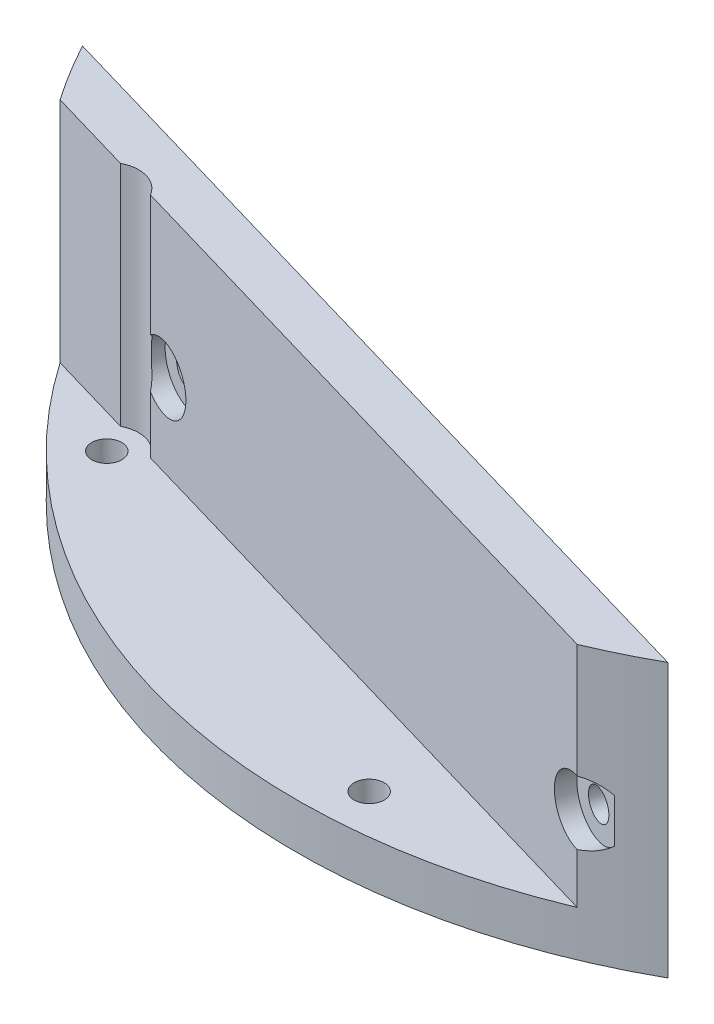
ISO-10303-21;
HEADER;
FILE_DESCRIPTION(('STEP AP214'),'2;1');
FILE_NAME('part.step','',(''),(''),'','','');
FILE_SCHEMA(('AUTOMOTIVE_DESIGN { 1 0 10303 214 1 1 1 1 }'));
ENDSEC;
DATA;
#1=APPLICATION_CONTEXT('core data for automotive mechanical design processes');
#2=APPLICATION_PROTOCOL_DEFINITION('international standard','automotive_design',2000,#1);
#3=PRODUCT_CONTEXT('',#1,'mechanical');
#4=PRODUCT('Part','Part','',(#3));
#5=PRODUCT_RELATED_PRODUCT_CATEGORY('part','',(#4));
#6=PRODUCT_DEFINITION_FORMATION('','',#4);
#7=PRODUCT_DEFINITION_CONTEXT('part definition',#1,'design');
#8=PRODUCT_DEFINITION('design','',#6,#7);
#9=PRODUCT_DEFINITION_SHAPE('','',#8);
#10=(LENGTH_UNIT() NAMED_UNIT(*) SI_UNIT(.MILLI.,.METRE.));
#11=(NAMED_UNIT(*) PLANE_ANGLE_UNIT() SI_UNIT($,.RADIAN.));
#12=(NAMED_UNIT(*) SI_UNIT($,.STERADIAN.) SOLID_ANGLE_UNIT());
#13=UNCERTAINTY_MEASURE_WITH_UNIT(LENGTH_MEASURE(1.E-05),#10,'distance_accuracy_value','');
#14=(GEOMETRIC_REPRESENTATION_CONTEXT(3) GLOBAL_UNCERTAINTY_ASSIGNED_CONTEXT((#13)) GLOBAL_UNIT_ASSIGNED_CONTEXT((#10,
#11,#12)) REPRESENTATION_CONTEXT('',''));
#15=CARTESIAN_POINT('',(0.,0.,0.));
#16=DIRECTION('',(0.,0.,1.));
#17=DIRECTION('',(1.,0.,0.));
#18=AXIS2_PLACEMENT_3D('',#15,#16,#17);
#19=CARTESIAN_POINT('',(-13.0108216211059,5.,44.5801763202411));
#20=DIRECTION('',(-0.280164117594872,0.,0.959952117145583));
#21=DIRECTION('',(0.959952117145583,0.,0.280164117594872));
#22=AXIS2_PLACEMENT_3D('',#19,#20,#21);
#23=PLANE('',#22);
#24=CARTESIAN_POINT('',(26.888204443433,14.,56.2247940367006));
#25=DIRECTION('',(-0.280164117594872,0.,0.959952117145583));
#26=DIRECTION('',(0.959952117145583,0.,0.280164117594872));
#27=AXIS2_PLACEMENT_3D('',#24,#25,#26);
#28=CIRCLE('',#27,1.64999999999999);
#29=CARTESIAN_POINT('',(28.4721254367232,14.,56.6870648307322));
#30=VERTEX_POINT('',#29);
#31=EDGE_CURVE('E145',#30,#30,#28,.T.);
#32=ORIENTED_EDGE('',*,*,#31,.T.);
#33=EDGE_LOOP('',(#32));
#34=FACE_BOUND('',#33,.T.);
#35=CARTESIAN_POINT('',(-36.9486113467483,14.,37.5938802166416));
#36=DIRECTION('',(-0.280164117594872,0.,0.959952117145583));
#37=DIRECTION('',(0.959952117145583,0.,0.280164117594872));
#38=AXIS2_PLACEMENT_3D('',#35,#36,#37);
#39=CIRCLE('',#38,1.65);
#40=CARTESIAN_POINT('',(-35.3646903534581,14.,38.0561510106732));
#41=VERTEX_POINT('',#40);
#42=EDGE_CURVE('E176',#41,#41,#39,.T.);
#43=ORIENTED_EDGE('',*,*,#42,.T.);
#44=EDGE_LOOP('',(#43));
#45=FACE_BOUND('',#44,.T.);
#46=DIRECTION('',(0.,-1.,0.));
#47=VECTOR('',#46,1.);
#48=CARTESIAN_POINT('',(-58.3667956543592,30.,31.3429364457493));
#49=LINE('',#48,#47);
#50=CARTESIAN_POINT('',(-58.3667956543592,30.,31.3429364457492));
#51=VERTEX_POINT('',#50);
#52=CARTESIAN_POINT('',(-58.3667956543592,0.,31.3429364457493));
#53=VERTEX_POINT('',#52);
#54=EDGE_CURVE('E120',#51,#53,#49,.T.);
#55=ORIENTED_EDGE('',*,*,#54,.F.);
#56=DIRECTION('',(-0.959952117145583,0.,-0.280164117594872));
#57=VECTOR('',#56,1.);
#58=CARTESIAN_POINT('',(-58.7697252563864,30.,31.2253405632166));
#59=LINE('',#58,#57);
#60=CARTESIAN_POINT('',(32.3451524121474,30.,57.8174161947328));
#61=VERTEX_POINT('',#60);
#62=EDGE_CURVE('E128',#61,#51,#59,.T.);
#63=ORIENTED_EDGE('',*,*,#62,.F.);
#64=DIRECTION('',(0.,-1.,0.));
#65=VECTOR('',#64,1.);
#66=CARTESIAN_POINT('',(32.3451524121474,30.,57.8174161947329));
#67=LINE('',#66,#65);
#68=CARTESIAN_POINT('',(32.3451524121474,0.,57.8174161947329));
#69=VERTEX_POINT('',#68);
#70=EDGE_CURVE('E109',#69,#61,#67,.F.);
#71=ORIENTED_EDGE('',*,*,#70,.F.);
#72=DIRECTION('',(-0.959952117145583,0.,-0.280164117594872));
#73=VECTOR('',#72,1.);
#74=CARTESIAN_POINT('',(-13.0108216211059,0.,44.5801763202411));
#75=LINE('',#74,#73);
#76=EDGE_CURVE('E160',#69,#53,#75,.T.);
#77=ORIENTED_EDGE('',*,*,#76,.T.);
#78=EDGE_LOOP('',(#55,#63,#71,#77));
#79=FACE_BOUND('',#78,.T.);
#80=ADVANCED_FACE('F41',(#34,#45,#79),#23,.F.);
#81=CARTESIAN_POINT('',(0.,5.,0.));
#82=DIRECTION('',(0.,1.,0.));
#83=DIRECTION('',(0.,0.,1.));
#84=AXIS2_PLACEMENT_3D('',#81,#82,#83);
#85=PLANE('',#84);
#86=CARTESIAN_POINT('',(-43.522422382032,5.,43.522422382032));
#87=DIRECTION('',(0.,1.,0.));
#88=DIRECTION('',(0.,0.,1.));
#89=AXIS2_PLACEMENT_3D('',#86,#87,#88);
#90=CIRCLE('',#89,1.65);
#91=CARTESIAN_POINT('',(-43.522422382032,5.,45.172422382032));
#92=VERTEX_POINT('',#91);
#93=EDGE_CURVE('E157',#92,#92,#90,.T.);
#94=ORIENTED_EDGE('',*,*,#93,.F.);
#95=EDGE_LOOP('',(#94));
#96=FACE_BOUND('',#95,.T.);
#97=CARTESIAN_POINT('',(3.22127810675323,5.,61.465647864144));
#98=DIRECTION('',(0.,1.,0.));
#99=DIRECTION('',(0.,0.,1.));
#100=AXIS2_PLACEMENT_3D('',#97,#98,#99);
#101=CIRCLE('',#100,1.65);
#102=CARTESIAN_POINT('',(3.22127810675323,5.,63.115647864144));
#103=VERTEX_POINT('',#102);
#104=EDGE_CURVE('E49',#103,#103,#101,.T.);
#105=ORIENTED_EDGE('',*,*,#104,.F.);
#106=EDGE_LOOP('',(#105));
#107=FACE_BOUND('',#106,.T.);
#108=DIRECTION('',(0.959952117145583,0.,0.280164117594872));
#109=VECTOR('',#108,1.);
#110=CARTESIAN_POINT('',(-54.9442366709352,5.,37.5504108718968));
#111=LINE('',#110,#109);
#112=CARTESIAN_POINT('',(-54.488796953541,5.,37.6833319460445));
#113=VERTEX_POINT('',#112);
#114=CARTESIAN_POINT('',(-45.1315629455846,5.,40.4142610852635));
#115=VERTEX_POINT('',#114);
#116=EDGE_CURVE('E142',#113,#115,#111,.T.);
#117=ORIENTED_EDGE('',*,*,#116,.F.);
#118=CARTESIAN_POINT('',(0.,5.,0.));
#119=DIRECTION('',(0.,1.,0.));
#120=DIRECTION('',(0.,0.,1.));
#121=AXIS2_PLACEMENT_3D('',#118,#119,#120);
#122=CIRCLE('',#121,66.25);
#123=CARTESIAN_POINT('',(25.6655125353805,5.,61.0765418658934));
#124=VERTEX_POINT('',#123);
#125=EDGE_CURVE('E303',#113,#124,#122,.T.);
#126=ORIENTED_EDGE('',*,*,#125,.T.);
#127=DIRECTION('',(0.959952117145583,0.,0.280164117594872));
#128=VECTOR('',#127,1.);
#129=CARTESIAN_POINT('',(-40.4940474039868,5.,41.7677301034971));
#130=LINE('',#129,#128);
#131=CARTESIAN_POINT('',(-40.4940474039868,5.,41.7677301034971));
#132=VERTEX_POINT('',#131);
#133=EDGE_CURVE('E148',#132,#124,#130,.T.);
#134=ORIENTED_EDGE('',*,*,#133,.F.);
#135=CARTESIAN_POINT('',(-43.522422382032,5.,43.522422382032));
#136=DIRECTION('',(0.,-1.,0.));
#137=DIRECTION('',(0.,0.,1.));
#138=AXIS2_PLACEMENT_3D('',#135,#136,#137);
#139=CIRCLE('',#138,3.5);
#140=EDGE_CURVE('E144',#115,#132,#139,.T.);
#141=ORIENTED_EDGE('',*,*,#140,.F.);
#142=EDGE_LOOP('',(#117,#126,#134,#141));
#143=FACE_BOUND('',#142,.T.);
#144=ADVANCED_FACE('F231',(#96,#107,#143),#85,.T.);
#145=CARTESIAN_POINT('',(0.,0.,0.));
#146=DIRECTION('',(0.,1.,0.));
#147=DIRECTION('',(0.,0.,1.));
#148=AXIS2_PLACEMENT_3D('',#145,#146,#147);
#149=PLANE('',#148);
#150=CARTESIAN_POINT('',(3.22127810675323,0.,61.465647864144));
#151=DIRECTION('',(0.,1.,0.));
#152=DIRECTION('',(0.,0.,1.));
#153=AXIS2_PLACEMENT_3D('',#150,#151,#152);
#154=CIRCLE('',#153,1.65);
#155=CARTESIAN_POINT('',(3.22127810675323,0.,63.115647864144));
#156=VERTEX_POINT('',#155);
#157=EDGE_CURVE('E165',#156,#156,#154,.T.);
#158=ORIENTED_EDGE('',*,*,#157,.T.);
#159=EDGE_LOOP('',(#158));
#160=FACE_BOUND('',#159,.T.);
#161=CARTESIAN_POINT('',(-43.522422382032,0.,43.522422382032));
#162=DIRECTION('',(0.,1.,0.));
#163=DIRECTION('',(0.,0.,1.));
#164=AXIS2_PLACEMENT_3D('',#161,#162,#163);
#165=CIRCLE('',#164,1.65);
#166=CARTESIAN_POINT('',(-43.522422382032,0.,45.172422382032));
#167=VERTEX_POINT('',#166);
#168=EDGE_CURVE('E156',#167,#167,#165,.T.);
#169=ORIENTED_EDGE('',*,*,#168,.T.);
#170=EDGE_LOOP('',(#169));
#171=FACE_BOUND('',#170,.T.);
#172=CARTESIAN_POINT('',(0.,0.,0.));
#173=DIRECTION('',(0.,-1.,0.));
#174=DIRECTION('',(0.,0.,-1.));
#175=AXIS2_PLACEMENT_3D('',#172,#173,#174);
#176=CIRCLE('',#175,66.25);
#177=EDGE_CURVE('E115',#69,#53,#176,.T.);
#178=ORIENTED_EDGE('',*,*,#177,.T.);
#179=ORIENTED_EDGE('',*,*,#76,.F.);
#180=EDGE_LOOP('',(#178,#179));
#181=FACE_BOUND('',#180,.T.);
#182=ADVANCED_FACE('F228',(#160,#171,#181),#149,.F.);
#183=CARTESIAN_POINT('',(-54.9442366709352,30.,37.5504108718968));
#184=DIRECTION('',(0.280164117594872,0.,-0.959952117145583));
#185=DIRECTION('',(-0.959952117145583,0.,-0.280164117594872));
#186=AXIS2_PLACEMENT_3D('',#183,#184,#185);
#187=PLANE('',#186);
#188=DIRECTION('',(0.,-1.,0.));
#189=VECTOR('',#188,1.);
#190=CARTESIAN_POINT('',(-54.488796953541,30.,37.6833319460445));
#191=LINE('',#190,#189);
#192=CARTESIAN_POINT('',(-54.488796953541,30.,37.6833319460445));
#193=VERTEX_POINT('',#192);
#194=EDGE_CURVE('E121',#113,#193,#191,.F.);
#195=ORIENTED_EDGE('',*,*,#194,.F.);
#196=ORIENTED_EDGE('',*,*,#116,.T.);
#197=DIRECTION('',(0.,-1.,0.));
#198=VECTOR('',#197,1.);
#199=CARTESIAN_POINT('',(-45.1315629455846,30.,40.4142610852635));
#200=LINE('',#199,#198);
#201=CARTESIAN_POINT('',(-45.1315629455846,30.,40.4142610852635));
#202=VERTEX_POINT('',#201);
#203=EDGE_CURVE('E153',#202,#115,#200,.T.);
#204=ORIENTED_EDGE('',*,*,#203,.F.);
#205=DIRECTION('',(0.959952117145583,0.,0.280164117594872));
#206=VECTOR('',#205,1.);
#207=CARTESIAN_POINT('',(-54.9442366709352,30.,37.5504108718968));
#208=LINE('',#207,#206);
#209=EDGE_CURVE('E150',#193,#202,#208,.T.);
#210=ORIENTED_EDGE('',*,*,#209,.F.);
#211=EDGE_LOOP('',(#195,#196,#204,#210));
#212=FACE_BOUND('',#211,.T.);
#213=ADVANCED_FACE('F223',(#212),#187,.F.);
#214=CARTESIAN_POINT('',(-40.4940474039868,30.,41.7677301034971));
#215=DIRECTION('',(0.280164117594872,0.,-0.959952117145583));
#216=DIRECTION('',(-0.959952117145583,0.,-0.280164117594872));
#217=AXIS2_PLACEMENT_3D('',#214,#215,#216);
#218=PLANE('',#217);
#219=DIRECTION('',(0.,-1.,0.));
#220=VECTOR('',#219,1.);
#221=CARTESIAN_POINT('',(25.6655125353805,30.,61.0765418658934));
#222=LINE('',#221,#220);
#223=CARTESIAN_POINT('',(25.6655125353805,30.,61.0765418658934));
#224=VERTEX_POINT('',#223);
#225=CARTESIAN_POINT('',(25.6655125353805,17.4950776099976,61.0765418658934));
#226=VERTEX_POINT('',#225);
#227=EDGE_CURVE('E301',#224,#226,#222,.T.);
#228=ORIENTED_EDGE('',*,*,#227,.F.);
#229=DIRECTION('',(0.959952117145583,0.,0.280164117594872));
#230=VECTOR('',#229,1.);
#231=CARTESIAN_POINT('',(-40.4940474039868,30.,41.7677301034971));
#232=LINE('',#231,#230);
#233=CARTESIAN_POINT('',(-40.4940474039868,30.,41.7677301034971));
#234=VERTEX_POINT('',#233);
#235=EDGE_CURVE('E130',#234,#224,#232,.T.);
#236=ORIENTED_EDGE('',*,*,#235,.F.);
#237=DIRECTION('',(0.,-1.,0.));
#238=VECTOR('',#237,1.);
#239=CARTESIAN_POINT('',(-40.4940474039868,30.,41.7677301034971));
#240=LINE('',#239,#238);
#241=CARTESIAN_POINT('',(-40.4940474039868,16.6942272149969,41.7677301034971));
#242=VERTEX_POINT('',#241);
#243=EDGE_CURVE('E136',#234,#242,#240,.T.);
#244=ORIENTED_EDGE('',*,*,#243,.T.);
#245=CARTESIAN_POINT('',(-38.3494319347227,14.,42.3936408023695));
#246=DIRECTION('',(-0.280164117594872,0.,0.959952117145583));
#247=DIRECTION('',(0.959952117145583,0.,0.280164117594872));
#248=AXIS2_PLACEMENT_3D('',#245,#246,#247);
#249=CIRCLE('',#248,3.5);
#250=CARTESIAN_POINT('',(-40.4940474039868,11.3057727850031,41.7677301034971));
#251=VERTEX_POINT('',#250);
#252=EDGE_CURVE('E287',#251,#242,#249,.T.);
#253=ORIENTED_EDGE('',*,*,#252,.F.);
#254=EDGE_CURVE('E134',#251,#132,#240,.T.);
#255=ORIENTED_EDGE('',*,*,#254,.T.);
#256=ORIENTED_EDGE('',*,*,#133,.T.);
#257=CARTESIAN_POINT('',(25.6655125353805,10.5049223900024,61.0765418658934));
#258=VERTEX_POINT('',#257);
#259=EDGE_CURVE('E304',#258,#124,#222,.T.);
#260=ORIENTED_EDGE('',*,*,#259,.F.);
#261=CARTESIAN_POINT('',(25.4873838554586,14.,61.0245546224285));
#262=DIRECTION('',(-0.280164117594872,0.,0.959952117145583));
#263=DIRECTION('',(0.959952117145583,0.,0.280164117594872));
#264=AXIS2_PLACEMENT_3D('',#261,#262,#263);
#265=CIRCLE('',#264,3.5);
#266=EDGE_CURVE('E284',#226,#258,#265,.T.);
#267=ORIENTED_EDGE('',*,*,#266,.F.);
#268=EDGE_LOOP('',(#228,#236,#244,#253,#255,#256,#260,#267));
#269=FACE_BOUND('',#268,.T.);
#270=ADVANCED_FACE('F221',(#269),#218,.F.);
#271=CARTESIAN_POINT('',(0.,30.,0.));
#272=DIRECTION('',(0.,1.,0.));
#273=DIRECTION('',(0.,0.,1.));
#274=AXIS2_PLACEMENT_3D('',#271,#272,#273);
#275=PLANE('',#274);
#276=ORIENTED_EDGE('',*,*,#235,.T.);
#277=CARTESIAN_POINT('',(0.,30.,0.));
#278=DIRECTION('',(0.,-1.,0.));
#279=DIRECTION('',(0.,0.,-1.));
#280=AXIS2_PLACEMENT_3D('',#277,#278,#279);
#281=CIRCLE('',#280,66.25);
#282=EDGE_CURVE('E112',#61,#224,#281,.T.);
#283=ORIENTED_EDGE('',*,*,#282,.F.);
#284=ORIENTED_EDGE('',*,*,#62,.T.);
#285=EDGE_CURVE('E131',#193,#51,#281,.T.);
#286=ORIENTED_EDGE('',*,*,#285,.F.);
#287=ORIENTED_EDGE('',*,*,#209,.T.);
#288=CARTESIAN_POINT('',(-43.522422382032,30.,43.522422382032));
#289=DIRECTION('',(0.,-1.,0.));
#290=DIRECTION('',(0.,0.,1.));
#291=AXIS2_PLACEMENT_3D('',#288,#289,#290);
#292=CIRCLE('',#291,3.5);
#293=EDGE_CURVE('E138',#202,#234,#292,.T.);
#294=ORIENTED_EDGE('',*,*,#293,.T.);
#295=EDGE_LOOP('',(#276,#283,#284,#286,#287,#294));
#296=FACE_BOUND('',#295,.T.);
#297=ADVANCED_FACE('F126',(#296),#275,.T.);
#298=CARTESIAN_POINT('',(26.0477120906484,14.,59.1046503881374));
#299=DIRECTION('',(-0.280164117594872,0.,0.959952117145583));
#300=DIRECTION('',(0.959952117145583,0.,0.280164117594872));
#301=AXIS2_PLACEMENT_3D('',#298,#299,#300);
#302=CYLINDRICAL_SURFACE('',#301,3.5);
#303=CARTESIAN_POINT('',(28.4819093861633,11.5875367921795,59.8150761741418));
#304=CARTESIAN_POINT('',(28.3744268892253,11.4942026766855,59.8662618349527));
#305=CARTESIAN_POINT('',(28.262506606396,11.4071384533856,59.9191933645326));
#306=CARTESIAN_POINT('',(28.0314257366292,11.2454086954693,60.0276414496423));
#307=CARTESIAN_POINT('',(27.9122743839164,11.1707277840021,60.0831546879432));
#308=CARTESIAN_POINT('',(27.6710674427194,11.0350657101046,60.1946159916516));
#309=CARTESIAN_POINT('',(27.5491535256775,10.9737948856385,60.2505204437388));
#310=CARTESIAN_POINT('',(27.3008091038937,10.8624930885034,60.3634571855226));
#311=CARTESIAN_POINT('',(27.1743774901579,10.8124648979266,60.4204897505904));
#312=CARTESIAN_POINT('',(26.8262957689971,10.6917314686765,60.5761513500884));
#313=CARTESIAN_POINT('',(26.6010881612879,10.6317516215983,60.6754173510321));
#314=CARTESIAN_POINT('',(26.2562865248015,10.5656661658201,60.8250457175174));
#315=CARTESIAN_POINT('',(26.1388960893278,10.547558360551,60.8755867348842));
#316=CARTESIAN_POINT('',(25.902961028312,10.519850744111,60.9763525510729));
#317=CARTESIAN_POINT('',(25.7844162439336,10.5102521210011,61.0265773047661));
#318=CARTESIAN_POINT('',(25.6655125353805,10.5049223900024,61.0765418658934));
#319=B_SPLINE_CURVE_WITH_KNOTS('',3,(#303,#304,#305,#306,#307,#308,#309,#310,#311,#312,#313,
#314,#315,#316,#317,#318),.UNSPECIFIED.,.F.,.F.,(4,2,2,2,2,2,2,4),(0.,0.453434704967621,
0.906302075759054,1.34812622917768,1.79005959590942,2.54739956040174,2.93442165449378,
3.32149777651905),.UNSPECIFIED.);
#320=CARTESIAN_POINT('',(28.4819093861633,11.5875367921794,59.8150761741418));
#321=VERTEX_POINT('',#320);
#322=EDGE_CURVE('E264',#321,#258,#319,.T.);
#323=ORIENTED_EDGE('',*,*,#322,.F.);
#324=CARTESIAN_POINT('',(26.0477120906484,14.,59.1046503881374));
#325=DIRECTION('',(-0.280164117594872,0.,0.959952117145583));
#326=DIRECTION('',(0.959952117145583,0.,0.280164117594872));
#327=AXIS2_PLACEMENT_3D('',#324,#325,#326);
#328=CIRCLE('',#327,3.5);
#329=CARTESIAN_POINT('',(28.4819093861633,16.4124632078206,59.8150761741418));
#330=VERTEX_POINT('',#329);
#331=EDGE_CURVE('E172',#330,#321,#328,.T.);
#332=ORIENTED_EDGE('',*,*,#331,.F.);
#333=CARTESIAN_POINT('',(25.6655125353805,17.4950776099976,61.0765418658934));
#334=CARTESIAN_POINT('',(25.8036854333837,17.488885542517,61.0184837103049));
#335=CARTESIAN_POINT('',(25.9414423221483,17.4769183692864,60.9600394700664));
#336=CARTESIAN_POINT('',(26.2153402442106,17.4414883200504,60.8427520917362));
#337=CARTESIAN_POINT('',(26.3514808493499,17.4180224646618,60.7839088541607));
#338=CARTESIAN_POINT('',(26.6179429665665,17.3603768907799,60.6676870670659));
#339=CARTESIAN_POINT('',(26.7483250513793,17.3264774210455,60.6103083980054));
#340=CARTESIAN_POINT('',(27.0059385129889,17.2477618116034,60.4959637296411));
#341=CARTESIAN_POINT('',(27.1331701526938,17.2029465862326,60.4389976961848));
#342=CARTESIAN_POINT('',(27.3673549076727,17.1088273772459,60.3332800977232));
#343=CARTESIAN_POINT('',(27.4747976053172,17.0608597753892,60.284421527747));
#344=CARTESIAN_POINT('',(27.6859472940192,16.9564821476321,60.1877421539485));
#345=CARTESIAN_POINT('',(27.7896555050708,16.900074910438,60.1399210132828));
#346=CARTESIAN_POINT('',(27.9948532019882,16.7773367151002,60.0446811320152));
#347=CARTESIAN_POINT('',(28.0962442428033,16.7108153537007,59.9972941821206));
#348=CARTESIAN_POINT('',(28.2935022933062,16.5685727816028,59.9045260120214));
#349=CARTESIAN_POINT('',(28.3893633885576,16.4928419805805,59.8591469509652));
#350=CARTESIAN_POINT('',(28.4819093861633,16.4124632078206,59.8150761741418));
#351=B_SPLINE_CURVE_WITH_KNOTS('',3,(#333,#334,#335,#336,#337,#338,#339,#340,#341,#342,#343,
#344,#345,#346,#347,#348,#349,#350),.UNSPECIFIED.,.F.,.F.,(4,2,2,2,2,2,2,2,4),(0.,
0.449904980009137,0.899926595009775,1.33878341113055,1.77760347989564,2.15950030584928,
2.54127121928639,2.93140943431199,3.32195745904239),.UNSPECIFIED.);
#352=EDGE_CURVE('E56',#226,#330,#351,.T.);
#353=ORIENTED_EDGE('',*,*,#352,.F.);
#354=ORIENTED_EDGE('',*,*,#266,.T.);
#355=EDGE_LOOP('',(#323,#332,#353,#354));
#356=FACE_BOUND('',#355,.T.);
#357=ADVANCED_FACE('F204',(#356),#302,.F.);
#358=CARTESIAN_POINT('',(26.0477120906484,14.,59.1046503881374));
#359=DIRECTION('',(-0.280164117594872,0.,0.959952117145583));
#360=DIRECTION('',(0.959952117145583,0.,0.280164117594872));
#361=AXIS2_PLACEMENT_3D('',#358,#359,#360);
#362=PLANE('',#361);
#363=CARTESIAN_POINT('',(26.0477120906483,14.,59.1046503881374));
#364=DIRECTION('',(-0.280164117594872,0.,0.959952117145583));
#365=DIRECTION('',(0.959952117145583,0.,0.280164117594872));
#366=AXIS2_PLACEMENT_3D('',#363,#364,#365);
#367=CIRCLE('',#366,1.64999999999999);
#368=CARTESIAN_POINT('',(27.6316330839385,14.,59.5669211821689));
#369=VERTEX_POINT('',#368);
#370=EDGE_CURVE('E169',#369,#369,#367,.F.);
#371=ORIENTED_EDGE('',*,*,#370,.T.);
#372=EDGE_LOOP('',(#371));
#373=FACE_BOUND('',#372,.T.);
#374=ORIENTED_EDGE('',*,*,#331,.T.);
#375=DIRECTION('',(0.,-1.,0.));
#376=VECTOR('',#375,1.);
#377=CARTESIAN_POINT('',(28.4819093861633,30.,59.8150761741418));
#378=LINE('',#377,#376);
#379=EDGE_CURVE('E11',#321,#330,#378,.F.);
#380=ORIENTED_EDGE('',*,*,#379,.T.);
#381=EDGE_LOOP('',(#374,#380));
#382=FACE_BOUND('',#381,.T.);
#383=ADVANCED_FACE('F218',(#373,#382),#362,.T.);
#384=CARTESIAN_POINT('',(-29.7652017695886,14.,12.9807024438554));
#385=DIRECTION('',(-0.280164117594872,0.,0.959952117145583));
#386=DIRECTION('',(0.959952117145583,0.,0.280164117594872));
#387=AXIS2_PLACEMENT_3D('',#384,#385,#386);
#388=CYLINDRICAL_SURFACE('',#387,1.65);
#389=ORIENTED_EDGE('',*,*,#42,.F.);
#390=EDGE_LOOP('',(#389));
#391=FACE_BOUND('',#390,.T.);
#392=CARTESIAN_POINT('',(-37.7891036995329,14.,40.4737365680784));
#393=DIRECTION('',(-0.280164117594872,0.,0.959952117145583));
#394=DIRECTION('',(0.959952117145583,0.,0.280164117594872));
#395=AXIS2_PLACEMENT_3D('',#392,#393,#394);
#396=CIRCLE('',#395,1.65);
#397=CARTESIAN_POINT('',(-36.2051827062427,14.,40.9360073621099));
#398=VERTEX_POINT('',#397);
#399=EDGE_CURVE('E171',#398,#398,#396,.F.);
#400=ORIENTED_EDGE('',*,*,#399,.F.);
#401=EDGE_LOOP('',(#400));
#402=FACE_BOUND('',#401,.T.);
#403=ADVANCED_FACE('F214',(#391,#402),#388,.F.);
#404=CARTESIAN_POINT('',(34.0716140205927,14.,31.6116162639144));
#405=DIRECTION('',(-0.280164117594872,0.,0.959952117145583));
#406=DIRECTION('',(0.959952117145583,0.,0.280164117594872));
#407=AXIS2_PLACEMENT_3D('',#404,#405,#406);
#408=CYLINDRICAL_SURFACE('',#407,1.64999999999999);
#409=ORIENTED_EDGE('',*,*,#31,.F.);
#410=EDGE_LOOP('',(#409));
#411=FACE_BOUND('',#410,.T.);
#412=ORIENTED_EDGE('',*,*,#370,.F.);
#413=EDGE_LOOP('',(#412));
#414=FACE_BOUND('',#413,.T.);
#415=ADVANCED_FACE('F210',(#411,#414),#408,.F.);
#416=CARTESIAN_POINT('',(3.22127810675323,5.,61.465647864144));
#417=DIRECTION('',(0.,-1.,0.));
#418=DIRECTION('',(0.,0.,-1.));
#419=AXIS2_PLACEMENT_3D('',#416,#417,#418);
#420=CYLINDRICAL_SURFACE('',#419,1.65);
#421=ORIENTED_EDGE('',*,*,#104,.T.);
#422=EDGE_LOOP('',(#421));
#423=FACE_BOUND('',#422,.T.);
#424=ORIENTED_EDGE('',*,*,#157,.F.);
#425=EDGE_LOOP('',(#424));
#426=FACE_BOUND('',#425,.T.);
#427=ADVANCED_FACE('F213',(#423,#426),#420,.F.);
#428=CARTESIAN_POINT('',(-43.522422382032,5.,43.522422382032));
#429=DIRECTION('',(0.,-1.,0.));
#430=DIRECTION('',(0.,0.,-1.));
#431=AXIS2_PLACEMENT_3D('',#428,#429,#430);
#432=CYLINDRICAL_SURFACE('',#431,1.65);
#433=ORIENTED_EDGE('',*,*,#93,.T.);
#434=EDGE_LOOP('',(#433));
#435=FACE_BOUND('',#434,.T.);
#436=ORIENTED_EDGE('',*,*,#168,.F.);
#437=EDGE_LOOP('',(#436));
#438=FACE_BOUND('',#437,.T.);
#439=ADVANCED_FACE('F43',(#435,#438),#432,.F.);
#440=CARTESIAN_POINT('',(-43.522422382032,30.,43.522422382032));
#441=DIRECTION('',(0.,-1.,0.));
#442=DIRECTION('',(0.,0.,-1.));
#443=AXIS2_PLACEMENT_3D('',#440,#441,#442);
#444=CYLINDRICAL_SURFACE('',#443,3.5);
#445=ORIENTED_EDGE('',*,*,#254,.F.);
#446=CARTESIAN_POINT('',(-40.4940474039868,11.3057727850031,41.7677301034971));
#447=CARTESIAN_POINT('',(-40.528733153158,11.3472698122374,41.707834674534));
#448=CARTESIAN_POINT('',(-40.5644228373167,11.3914114740109,41.6503647818433));
#449=CARTESIAN_POINT('',(-40.6368706395196,11.4848062526448,41.540532864644));
#450=CARTESIAN_POINT('',(-40.6736282218011,11.5340568371917,41.4881683343199));
#451=CARTESIAN_POINT('',(-40.747098861285,11.637238587066,41.3890271748515));
#452=CARTESIAN_POINT('',(-40.7838109823467,11.6911415334608,41.3422204536373));
#453=CARTESIAN_POINT('',(-40.8565169197601,11.8035644334818,41.253894435175));
#454=CARTESIAN_POINT('',(-40.8925107054618,11.8620845835891,41.212375363135));
#455=CARTESIAN_POINT('',(-40.9629242854401,11.9832949394062,41.1345947533251));
#456=CARTESIAN_POINT('',(-40.9973456953767,12.0459806944402,41.0983277317672));
#457=CARTESIAN_POINT('',(-41.0639442235055,12.1751632982937,41.0308094425514));
#458=CARTESIAN_POINT('',(-41.0961204196848,12.2416616926172,40.9995602287169));
#459=CARTESIAN_POINT('',(-41.15760620704,12.3780178091123,40.9418359956761));
#460=CARTESIAN_POINT('',(-41.1869143767391,12.4478771717475,40.9153633384391));
#461=CARTESIAN_POINT('',(-41.2421367941585,12.590453709022,40.8669298104862));
#462=CARTESIAN_POINT('',(-41.2680497647916,12.6631719457179,40.8449706357378));
#463=CARTESIAN_POINT('',(-41.3418375164841,12.8904852165619,40.7839412882009));
#464=CARTESIAN_POINT('',(-41.3833947197985,13.0491050487259,40.7518362819133));
#465=CARTESIAN_POINT('',(-41.4473174583393,13.372533441148,40.7036358375077));
#466=CARTESIAN_POINT('',(-41.4696752032454,13.5373444852522,40.6875468976042));
#467=CARTESIAN_POINT('',(-41.4884729503259,13.7935890908454,40.6740754383456));
#468=CARTESIAN_POINT('',(-41.4920755985292,13.8843074483971,40.6715132696746));
#469=CARTESIAN_POINT('',(-41.4931881253229,14.0658240086119,40.6707179024348));
#470=CARTESIAN_POINT('',(-41.4906976396424,14.1566222157243,40.6724849626839));
#471=CARTESIAN_POINT('',(-41.4796559357999,14.3376567100492,40.6803898804241));
#472=CARTESIAN_POINT('',(-41.4711045557806,14.4278929821901,40.6865278546413));
#473=CARTESIAN_POINT('',(-41.4480765210406,14.607225078093,40.7033280376179));
#474=CARTESIAN_POINT('',(-41.4335971885924,14.6963203676785,40.7139922910321));
#475=CARTESIAN_POINT('',(-41.3985975164404,14.8745215271084,40.7403623618448));
#476=CARTESIAN_POINT('',(-41.3779581944374,14.9635893463897,40.7561680864969));
#477=CARTESIAN_POINT('',(-41.3311567504874,15.1390919695341,40.7930923649513));
#478=CARTESIAN_POINT('',(-41.3049973021322,15.2255280249461,40.8142083477544));
#479=CARTESIAN_POINT('',(-41.2476724171537,15.3951136545372,40.8621763593635));
#480=CARTESIAN_POINT('',(-41.2165059313232,15.47826253534,40.88902959078));
#481=CARTESIAN_POINT('',(-41.1498656279885,15.6405128408197,40.9489074081836));
#482=CARTESIAN_POINT('',(-41.1143923128764,15.7196147360508,40.9819312746071));
#483=CARTESIAN_POINT('',(-41.0419367213816,15.8690715124932,41.0526818178968));
#484=CARTESIAN_POINT('',(-41.0051275134704,15.9396672096944,41.0900767157421));
#485=CARTESIAN_POINT('',(-40.9293243950186,16.0759600103113,41.171057681927));
#486=CARTESIAN_POINT('',(-40.8903308330473,16.1416578914201,41.2146427641599));
#487=CARTESIAN_POINT('',(-40.8112823320116,16.2674902813125,41.3080480769854));
#488=CARTESIAN_POINT('',(-40.7712299336329,16.3276367839048,41.3578542910943));
#489=CARTESIAN_POINT('',(-40.6911379567276,16.4420817801291,41.4637272831988));
#490=CARTESIAN_POINT('',(-40.6510983894337,16.4963844143551,41.5197895703999));
#491=CARTESIAN_POINT('',(-40.5916400293928,16.573654736734,41.6088350006215));
#492=CARTESIAN_POINT('',(-40.5717761389077,16.598884871111,41.6395884368734));
#493=CARTESIAN_POINT('',(-40.5325245521553,16.647746240621,41.7025632376023));
#494=CARTESIAN_POINT('',(-40.5131363530121,16.6713792150707,41.7347829391438));
#495=CARTESIAN_POINT('',(-40.4940474039868,16.6942272149969,41.7677301034971));
#496=B_SPLINE_CURVE_WITH_KNOTS('',3,(#446,#447,#448,#449,#450,#451,#452,#453,#454,#455,#456,
#457,#458,#459,#460,#461,#462,#463,#464,#465,#466,#467,#468,#469,#470,#471,#472,#473,#474,#475,
#476,#477,#478,#479,#480,#481,#482,#483,#484,#485,#486,#487,#488,#489,#490,#491,#492,#493,#494,
#495),.UNSPECIFIED.,.F.,.F.,(4,2,2,2,2,2,2,2,2,2,2,2,2,2,2,2,2,2,2,2,2,2,2,2,4),(0.,
0.242005617280049,0.483891848917671,0.724402122377119,0.964922636070504,1.2051901774807,
1.44555581275285,1.68603998312047,1.92661435229393,2.42566958998046,2.92492722741674,
3.19714032972389,3.46936970636777,3.74160635322504,4.0139661085732,4.2919706033586,
4.56984075855641,4.84776921660421,5.12566528535184,5.38918130700169,5.65265539709766,
5.91554622851178,6.17824954849138,6.31158842719843,6.44477967786702),.UNSPECIFIED.);
#497=EDGE_CURVE('E62',#251,#242,#496,.T.);
#498=ORIENTED_EDGE('',*,*,#497,.T.);
#499=ORIENTED_EDGE('',*,*,#243,.F.);
#500=ORIENTED_EDGE('',*,*,#293,.F.);
#501=ORIENTED_EDGE('',*,*,#203,.T.);
#502=ORIENTED_EDGE('',*,*,#140,.T.);
#503=EDGE_LOOP('',(#445,#498,#499,#500,#501,#502));
#504=FACE_BOUND('',#503,.T.);
#505=ADVANCED_FACE('F193',(#504),#444,.F.);
#506=CARTESIAN_POINT('',(-37.789103699533,14.,40.4737365680784));
#507=DIRECTION('',(-0.280164117594872,0.,0.959952117145583));
#508=DIRECTION('',(0.959952117145583,0.,0.280164117594872));
#509=AXIS2_PLACEMENT_3D('',#506,#507,#508);
#510=CYLINDRICAL_SURFACE('',#509,3.5);
#511=CARTESIAN_POINT('',(-37.789103699533,14.,40.4737365680784));
#512=DIRECTION('',(-0.280164117594872,0.,0.959952117145583));
#513=DIRECTION('',(0.959952117145583,0.,0.280164117594872));
#514=AXIS2_PLACEMENT_3D('',#511,#512,#513);
#515=CIRCLE('',#514,3.5);
#516=CARTESIAN_POINT('',(-34.4292712895234,14.,41.4543109796604));
#517=VERTEX_POINT('',#516);
#518=EDGE_CURVE('E190',#517,#517,#515,.T.);
#519=ORIENTED_EDGE('',*,*,#518,.F.);
#520=EDGE_LOOP('',(#519));
#521=FACE_BOUND('',#520,.T.);
#522=ORIENTED_EDGE('',*,*,#252,.T.);
#523=ORIENTED_EDGE('',*,*,#497,.F.);
#524=EDGE_LOOP('',(#522,#523));
#525=FACE_BOUND('',#524,.T.);
#526=ADVANCED_FACE('F197',(#521,#525),#510,.F.);
#527=CARTESIAN_POINT('',(-37.789103699533,14.,40.4737365680784));
#528=DIRECTION('',(-0.280164117594872,0.,0.959952117145583));
#529=DIRECTION('',(0.959952117145583,0.,0.280164117594872));
#530=AXIS2_PLACEMENT_3D('',#527,#528,#529);
#531=PLANE('',#530);
#532=ORIENTED_EDGE('',*,*,#518,.T.);
#533=EDGE_LOOP('',(#532));
#534=FACE_BOUND('',#533,.T.);
#535=ORIENTED_EDGE('',*,*,#399,.T.);
#536=EDGE_LOOP('',(#535));
#537=FACE_BOUND('',#536,.T.);
#538=ADVANCED_FACE('F202',(#534,#537),#531,.T.);
#539=CARTESIAN_POINT('',(0.,30.,0.));
#540=DIRECTION('',(0.,-1.,0.));
#541=DIRECTION('',(0.,0.,-1.));
#542=AXIS2_PLACEMENT_3D('',#539,#540,#541);
#543=CYLINDRICAL_SURFACE('',#542,66.25);
#544=ORIENTED_EDGE('',*,*,#54,.T.);
#545=ORIENTED_EDGE('',*,*,#177,.F.);
#546=ORIENTED_EDGE('',*,*,#70,.T.);
#547=ORIENTED_EDGE('',*,*,#282,.T.);
#548=ORIENTED_EDGE('',*,*,#227,.T.);
#549=ORIENTED_EDGE('',*,*,#352,.T.);
#550=ORIENTED_EDGE('',*,*,#379,.F.);
#551=ORIENTED_EDGE('',*,*,#322,.T.);
#552=ORIENTED_EDGE('',*,*,#259,.T.);
#553=ORIENTED_EDGE('',*,*,#125,.F.);
#554=ORIENTED_EDGE('',*,*,#194,.T.);
#555=ORIENTED_EDGE('',*,*,#285,.T.);
#556=EDGE_LOOP('',(#544,#545,#546,#547,#548,#549,#550,#551,#552,#553,#554,#555));
#557=FACE_BOUND('',#556,.T.);
#558=ADVANCED_FACE('F111',(#557),#543,.T.);
#559=CLOSED_SHELL('',(#80,#144,#182,#213,#270,#297,#357,#383,#403,#415,#427,#439,#505,#526,#538,#558));
#560=MANIFOLD_SOLID_BREP('B2',#559);
#561=ADVANCED_BREP_SHAPE_REPRESENTATION('',(#18,#560),#14);
#562=SHAPE_DEFINITION_REPRESENTATION(#9,#561);
ENDSEC;
END-ISO-10303-21;
